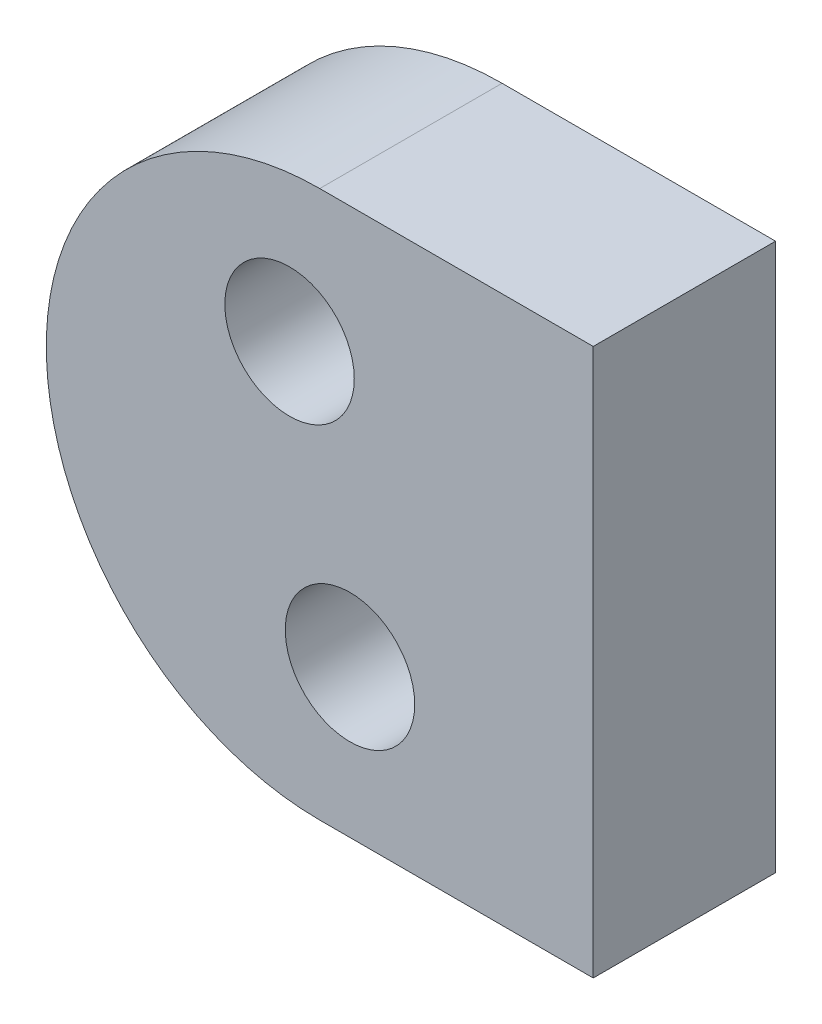
ISO-10303-21;
HEADER;
FILE_DESCRIPTION(('STEP AP214'),'2;1');
FILE_NAME('part.step','',(''),(''),'','','');
FILE_SCHEMA(('AUTOMOTIVE_DESIGN { 1 0 10303 214 1 1 1 1 }'));
ENDSEC;
DATA;
#1=APPLICATION_CONTEXT('core data for automotive mechanical design processes');
#2=APPLICATION_PROTOCOL_DEFINITION('international standard','automotive_design',2000,#1);
#3=PRODUCT_CONTEXT('',#1,'mechanical');
#4=PRODUCT('Part','Part','',(#3));
#5=PRODUCT_RELATED_PRODUCT_CATEGORY('part','',(#4));
#6=PRODUCT_DEFINITION_FORMATION('','',#4);
#7=PRODUCT_DEFINITION_CONTEXT('part definition',#1,'design');
#8=PRODUCT_DEFINITION('design','',#6,#7);
#9=PRODUCT_DEFINITION_SHAPE('','',#8);
#10=(LENGTH_UNIT() NAMED_UNIT(*) SI_UNIT(.MILLI.,.METRE.));
#11=(NAMED_UNIT(*) PLANE_ANGLE_UNIT() SI_UNIT($,.RADIAN.));
#12=(NAMED_UNIT(*) SI_UNIT($,.STERADIAN.) SOLID_ANGLE_UNIT());
#13=UNCERTAINTY_MEASURE_WITH_UNIT(LENGTH_MEASURE(1.E-05),#10,'distance_accuracy_value','');
#14=(GEOMETRIC_REPRESENTATION_CONTEXT(3) GLOBAL_UNCERTAINTY_ASSIGNED_CONTEXT((#13)) GLOBAL_UNIT_ASSIGNED_CONTEXT((#10,
#11,#12)) REPRESENTATION_CONTEXT('',''));
#15=CARTESIAN_POINT('',(0.,0.,0.));
#16=DIRECTION('',(0.,0.,1.));
#17=DIRECTION('',(1.,0.,0.));
#18=AXIS2_PLACEMENT_3D('',#15,#16,#17);
#19=CARTESIAN_POINT('',(0.414365520844233,-1.72595660870588,2.5));
#20=DIRECTION('',(0.,0.,1.));
#21=DIRECTION('',(1.,0.,0.));
#22=AXIS2_PLACEMENT_3D('',#19,#20,#21);
#23=PLANE('',#22);
#24=CARTESIAN_POINT('',(0.,0.,2.5));
#25=DIRECTION('',(0.,0.,1.));
#26=DIRECTION('',(1.,0.,0.));
#27=AXIS2_PLACEMENT_3D('',#24,#25,#26);
#28=CIRCLE('',#27,0.8875);
#29=CARTESIAN_POINT('',(0.8875,0.,2.5));
#30=VERTEX_POINT('',#29);
#31=EDGE_CURVE('E118',#30,#30,#28,.T.);
#32=ORIENTED_EDGE('',*,*,#31,.F.);
#33=EDGE_LOOP('',(#32));
#34=FACE_BOUND('',#33,.T.);
#35=DIRECTION('',(0.,1.,0.));
#36=VECTOR('',#35,1.);
#37=CARTESIAN_POINT('',(4.16436552084423,2.02404339129413,2.5));
#38=LINE('',#37,#36);
#39=CARTESIAN_POINT('',(4.16436552084423,-5.47595660870588,2.5));
#40=VERTEX_POINT('',#39);
#41=CARTESIAN_POINT('',(4.16436552084423,2.02404339129413,2.5));
#42=VERTEX_POINT('',#41);
#43=EDGE_CURVE('E98',#40,#42,#38,.T.);
#44=ORIENTED_EDGE('',*,*,#43,.T.);
#45=DIRECTION('',(-1.,0.,0.));
#46=VECTOR('',#45,1.);
#47=CARTESIAN_POINT('',(0.414365520844234,2.02404339129413,2.5));
#48=LINE('',#47,#46);
#49=CARTESIAN_POINT('',(0.414365520844234,2.02404339129413,2.5));
#50=VERTEX_POINT('',#49);
#51=EDGE_CURVE('E93',#42,#50,#48,.T.);
#52=ORIENTED_EDGE('',*,*,#51,.T.);
#53=CARTESIAN_POINT('',(0.414365520844233,-1.72595660870588,2.5));
#54=DIRECTION('',(0.,0.,1.));
#55=DIRECTION('',(1.,0.,0.));
#56=AXIS2_PLACEMENT_3D('',#53,#54,#55);
#57=CIRCLE('',#56,3.75);
#58=CARTESIAN_POINT('',(0.414365520844233,-5.47595660870588,2.5));
#59=VERTEX_POINT('',#58);
#60=EDGE_CURVE('E96',#50,#59,#57,.T.);
#61=ORIENTED_EDGE('',*,*,#60,.T.);
#62=DIRECTION('',(1.,0.,0.));
#63=VECTOR('',#62,1.);
#64=CARTESIAN_POINT('',(0.414365520844233,-5.47595660870588,2.5));
#65=LINE('',#64,#63);
#66=EDGE_CURVE('E63',#59,#40,#65,.T.);
#67=ORIENTED_EDGE('',*,*,#66,.T.);
#68=EDGE_LOOP('',(#44,#52,#61,#67));
#69=FACE_BOUND('',#68,.T.);
#70=CARTESIAN_POINT('',(0.828731041688467,-3.45191321741175,2.5));
#71=DIRECTION('',(0.,0.,1.));
#72=DIRECTION('',(1.,0.,0.));
#73=AXIS2_PLACEMENT_3D('',#70,#71,#72);
#74=CIRCLE('',#73,0.887499999999999);
#75=CARTESIAN_POINT('',(1.71623104168847,-3.45191321741175,2.5));
#76=VERTEX_POINT('',#75);
#77=EDGE_CURVE('E140',#76,#76,#74,.T.);
#78=ORIENTED_EDGE('',*,*,#77,.F.);
#79=EDGE_LOOP('',(#78));
#80=FACE_BOUND('',#79,.T.);
#81=ADVANCED_FACE('F45',(#34,#69,#80),#23,.T.);
#82=CARTESIAN_POINT('',(0.414365520844233,-1.72595660870588,0.));
#83=DIRECTION('',(0.,0.,1.));
#84=DIRECTION('',(1.,0.,0.));
#85=AXIS2_PLACEMENT_3D('',#82,#83,#84);
#86=PLANE('',#85);
#87=DIRECTION('',(0.,1.,0.));
#88=VECTOR('',#87,1.);
#89=CARTESIAN_POINT('',(4.16436552084423,2.02404339129413,0.));
#90=LINE('',#89,#88);
#91=CARTESIAN_POINT('',(4.16436552084423,-5.47595660870588,0.));
#92=VERTEX_POINT('',#91);
#93=CARTESIAN_POINT('',(4.16436552084423,2.02404339129413,0.));
#94=VERTEX_POINT('',#93);
#95=EDGE_CURVE('E114',#92,#94,#90,.T.);
#96=ORIENTED_EDGE('',*,*,#95,.F.);
#97=DIRECTION('',(1.,0.,0.));
#98=VECTOR('',#97,1.);
#99=CARTESIAN_POINT('',(0.414365520844233,-5.47595660870588,0.));
#100=LINE('',#99,#98);
#101=CARTESIAN_POINT('',(0.414365520844233,-5.47595660870588,0.));
#102=VERTEX_POINT('',#101);
#103=EDGE_CURVE('E86',#102,#92,#100,.T.);
#104=ORIENTED_EDGE('',*,*,#103,.F.);
#105=CARTESIAN_POINT('',(0.414365520844233,-1.72595660870588,0.));
#106=DIRECTION('',(0.,0.,1.));
#107=DIRECTION('',(1.,0.,0.));
#108=AXIS2_PLACEMENT_3D('',#105,#106,#107);
#109=CIRCLE('',#108,3.75);
#110=CARTESIAN_POINT('',(0.414365520844234,2.02404339129413,0.));
#111=VERTEX_POINT('',#110);
#112=EDGE_CURVE('E80',#111,#102,#109,.T.);
#113=ORIENTED_EDGE('',*,*,#112,.F.);
#114=DIRECTION('',(-1.,0.,0.));
#115=VECTOR('',#114,1.);
#116=CARTESIAN_POINT('',(0.414365520844234,2.02404339129413,0.));
#117=LINE('',#116,#115);
#118=EDGE_CURVE('E103',#94,#111,#117,.T.);
#119=ORIENTED_EDGE('',*,*,#118,.F.);
#120=EDGE_LOOP('',(#96,#104,#113,#119));
#121=FACE_BOUND('',#120,.T.);
#122=CARTESIAN_POINT('',(0.,0.,0.));
#123=DIRECTION('',(0.,0.,1.));
#124=DIRECTION('',(1.,0.,0.));
#125=AXIS2_PLACEMENT_3D('',#122,#123,#124);
#126=CIRCLE('',#125,0.8875);
#127=CARTESIAN_POINT('',(0.8875,0.,0.));
#128=VERTEX_POINT('',#127);
#129=EDGE_CURVE('E136',#128,#128,#126,.T.);
#130=ORIENTED_EDGE('',*,*,#129,.T.);
#131=EDGE_LOOP('',(#130));
#132=FACE_BOUND('',#131,.T.);
#133=CARTESIAN_POINT('',(0.828731041688467,-3.45191321741175,0.));
#134=DIRECTION('',(0.,0.,1.));
#135=DIRECTION('',(1.,0.,0.));
#136=AXIS2_PLACEMENT_3D('',#133,#134,#135);
#137=CIRCLE('',#136,0.887499999999999);
#138=CARTESIAN_POINT('',(1.71623104168847,-3.45191321741175,0.));
#139=VERTEX_POINT('',#138);
#140=EDGE_CURVE('E144',#139,#139,#137,.T.);
#141=ORIENTED_EDGE('',*,*,#140,.T.);
#142=EDGE_LOOP('',(#141));
#143=FACE_BOUND('',#142,.T.);
#144=ADVANCED_FACE('F131',(#121,#132,#143),#86,.F.);
#145=CARTESIAN_POINT('',(4.16436552084423,2.02404339129413,2.5));
#146=DIRECTION('',(-1.,0.,0.));
#147=DIRECTION('',(0.,0.,1.));
#148=AXIS2_PLACEMENT_3D('',#145,#146,#147);
#149=PLANE('',#148);
#150=ORIENTED_EDGE('',*,*,#95,.T.);
#151=DIRECTION('',(0.,0.,-1.));
#152=VECTOR('',#151,1.);
#153=CARTESIAN_POINT('',(4.16436552084423,2.02404339129413,2.5));
#154=LINE('',#153,#152);
#155=EDGE_CURVE('E11',#42,#94,#154,.T.);
#156=ORIENTED_EDGE('',*,*,#155,.F.);
#157=ORIENTED_EDGE('',*,*,#43,.F.);
#158=DIRECTION('',(0.,0.,-1.));
#159=VECTOR('',#158,1.);
#160=CARTESIAN_POINT('',(4.16436552084423,-5.47595660870588,2.5));
#161=LINE('',#160,#159);
#162=EDGE_CURVE('E110',#40,#92,#161,.T.);
#163=ORIENTED_EDGE('',*,*,#162,.T.);
#164=EDGE_LOOP('',(#150,#156,#157,#163));
#165=FACE_BOUND('',#164,.T.);
#166=ADVANCED_FACE('F47',(#165),#149,.F.);
#167=CARTESIAN_POINT('',(0.414365520844234,2.02404339129413,2.5));
#168=DIRECTION('',(0.,-1.,0.));
#169=DIRECTION('',(0.,0.,-1.));
#170=AXIS2_PLACEMENT_3D('',#167,#168,#169);
#171=PLANE('',#170);
#172=ORIENTED_EDGE('',*,*,#118,.T.);
#173=DIRECTION('',(0.,0.,-1.));
#174=VECTOR('',#173,1.);
#175=CARTESIAN_POINT('',(0.414365520844234,2.02404339129413,2.5));
#176=LINE('',#175,#174);
#177=EDGE_CURVE('E55',#50,#111,#176,.T.);
#178=ORIENTED_EDGE('',*,*,#177,.F.);
#179=ORIENTED_EDGE('',*,*,#51,.F.);
#180=ORIENTED_EDGE('',*,*,#155,.T.);
#181=EDGE_LOOP('',(#172,#178,#179,#180));
#182=FACE_BOUND('',#181,.T.);
#183=ADVANCED_FACE('F102',(#182),#171,.F.);
#184=CARTESIAN_POINT('',(0.414365520844233,-1.72595660870588,2.5));
#185=DIRECTION('',(0.,0.,-1.));
#186=DIRECTION('',(-1.,0.,0.));
#187=AXIS2_PLACEMENT_3D('',#184,#185,#186);
#188=CYLINDRICAL_SURFACE('',#187,3.75);
#189=ORIENTED_EDGE('',*,*,#112,.T.);
#190=DIRECTION('',(0.,0.,-1.));
#191=VECTOR('',#190,1.);
#192=CARTESIAN_POINT('',(0.414365520844233,-5.47595660870588,2.5));
#193=LINE('',#192,#191);
#194=EDGE_CURVE('E105',#59,#102,#193,.T.);
#195=ORIENTED_EDGE('',*,*,#194,.F.);
#196=ORIENTED_EDGE('',*,*,#60,.F.);
#197=ORIENTED_EDGE('',*,*,#177,.T.);
#198=EDGE_LOOP('',(#189,#195,#196,#197));
#199=FACE_BOUND('',#198,.T.);
#200=ADVANCED_FACE('F106',(#199),#188,.T.);
#201=CARTESIAN_POINT('',(0.414365520844233,-5.47595660870588,2.5));
#202=DIRECTION('',(0.,1.,0.));
#203=DIRECTION('',(0.,0.,1.));
#204=AXIS2_PLACEMENT_3D('',#201,#202,#203);
#205=PLANE('',#204);
#206=ORIENTED_EDGE('',*,*,#103,.T.);
#207=ORIENTED_EDGE('',*,*,#162,.F.);
#208=ORIENTED_EDGE('',*,*,#66,.F.);
#209=ORIENTED_EDGE('',*,*,#194,.T.);
#210=EDGE_LOOP('',(#206,#207,#208,#209));
#211=FACE_BOUND('',#210,.T.);
#212=ADVANCED_FACE('F128',(#211),#205,.F.);
#213=CARTESIAN_POINT('',(0.,0.,2.5));
#214=DIRECTION('',(0.,0.,-1.));
#215=DIRECTION('',(-1.,0.,0.));
#216=AXIS2_PLACEMENT_3D('',#213,#214,#215);
#217=CYLINDRICAL_SURFACE('',#216,0.8875);
#218=ORIENTED_EDGE('',*,*,#31,.T.);
#219=EDGE_LOOP('',(#218));
#220=FACE_BOUND('',#219,.T.);
#221=ORIENTED_EDGE('',*,*,#129,.F.);
#222=EDGE_LOOP('',(#221));
#223=FACE_BOUND('',#222,.T.);
#224=ADVANCED_FACE('F163',(#220,#223),#217,.F.);
#225=CARTESIAN_POINT('',(0.828731041688467,-3.45191321741175,2.5));
#226=DIRECTION('',(0.,0.,-1.));
#227=DIRECTION('',(-1.,0.,0.));
#228=AXIS2_PLACEMENT_3D('',#225,#226,#227);
#229=CYLINDRICAL_SURFACE('',#228,0.887499999999999);
#230=ORIENTED_EDGE('',*,*,#77,.T.);
#231=EDGE_LOOP('',(#230));
#232=FACE_BOUND('',#231,.T.);
#233=ORIENTED_EDGE('',*,*,#140,.F.);
#234=EDGE_LOOP('',(#233));
#235=FACE_BOUND('',#234,.T.);
#236=ADVANCED_FACE('F152',(#232,#235),#229,.F.);
#237=CLOSED_SHELL('',(#81,#144,#166,#183,#200,#212,#224,#236));
#238=MANIFOLD_SOLID_BREP('B2',#237);
#239=ADVANCED_BREP_SHAPE_REPRESENTATION('',(#18,#238),#14);
#240=SHAPE_DEFINITION_REPRESENTATION(#9,#239);
ENDSEC;
END-ISO-10303-21;
